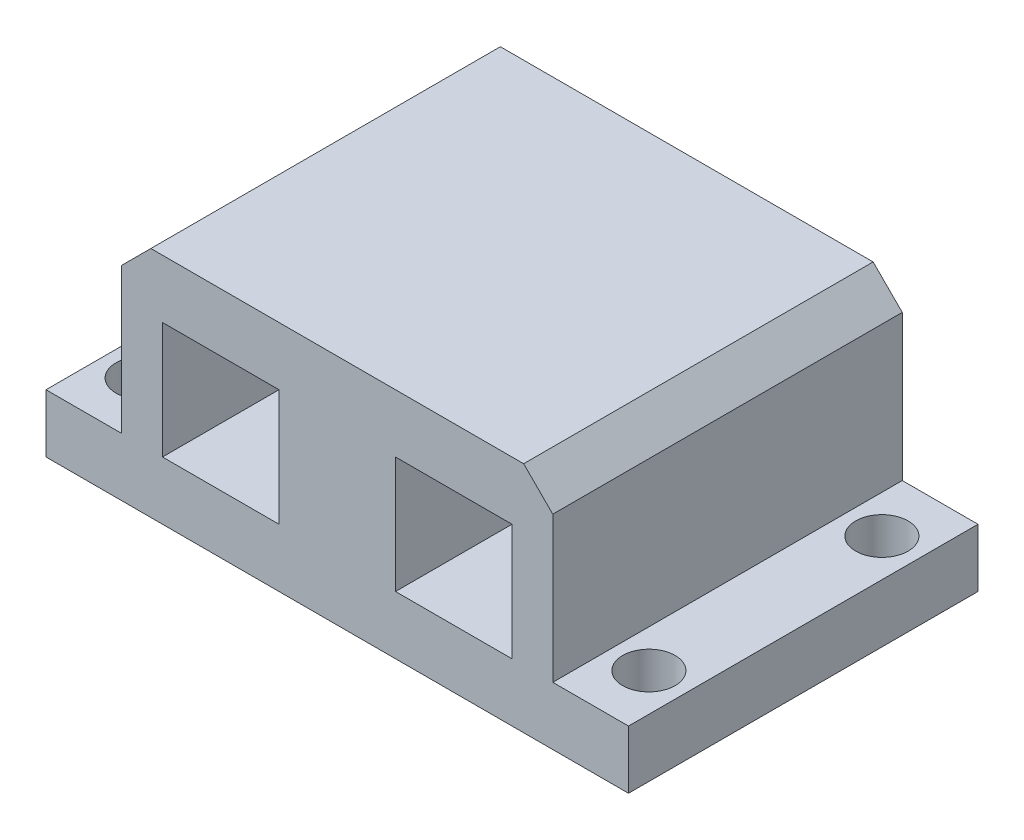
ISO-10303-21;
HEADER;
FILE_DESCRIPTION(('STEP AP214'),'2;1');
FILE_NAME('part.step','',(''),(''),'','','');
FILE_SCHEMA(('AUTOMOTIVE_DESIGN { 1 0 10303 214 1 1 1 1 }'));
ENDSEC;
DATA;
#1=APPLICATION_CONTEXT('core data for automotive mechanical design processes');
#2=APPLICATION_PROTOCOL_DEFINITION('international standard','automotive_design',2000,#1);
#3=PRODUCT_CONTEXT('',#1,'mechanical');
#4=PRODUCT('Part','Part','',(#3));
#5=PRODUCT_RELATED_PRODUCT_CATEGORY('part','',(#4));
#6=PRODUCT_DEFINITION_FORMATION('','',#4);
#7=PRODUCT_DEFINITION_CONTEXT('part definition',#1,'design');
#8=PRODUCT_DEFINITION('design','',#6,#7);
#9=PRODUCT_DEFINITION_SHAPE('','',#8);
#10=(LENGTH_UNIT() NAMED_UNIT(*) SI_UNIT(.MILLI.,.METRE.));
#11=(NAMED_UNIT(*) PLANE_ANGLE_UNIT() SI_UNIT($,.RADIAN.));
#12=(NAMED_UNIT(*) SI_UNIT($,.STERADIAN.) SOLID_ANGLE_UNIT());
#13=UNCERTAINTY_MEASURE_WITH_UNIT(LENGTH_MEASURE(1.E-05),#10,'distance_accuracy_value','');
#14=(GEOMETRIC_REPRESENTATION_CONTEXT(3) GLOBAL_UNCERTAINTY_ASSIGNED_CONTEXT((#13)) GLOBAL_UNIT_ASSIGNED_CONTEXT((#10,
#11,#12)) REPRESENTATION_CONTEXT('',''));
#15=CARTESIAN_POINT('',(0.,0.,0.));
#16=DIRECTION('',(0.,0.,1.));
#17=DIRECTION('',(1.,0.,0.));
#18=AXIS2_PLACEMENT_3D('',#15,#16,#17);
#19=CARTESIAN_POINT('',(-25.,-10.,30.));
#20=DIRECTION('',(0.,1.,0.));
#21=DIRECTION('',(0.,0.,1.));
#22=AXIS2_PLACEMENT_3D('',#19,#20,#21);
#23=PLANE('',#22);
#24=CARTESIAN_POINT('',(-21.75,-10.,25.));
#25=DIRECTION('',(0.,1.,0.));
#26=DIRECTION('',(0.,0.,1.));
#27=AXIS2_PLACEMENT_3D('',#24,#25,#26);
#28=CIRCLE('',#27,2.25);
#29=CARTESIAN_POINT('',(-21.75,-10.,27.25));
#30=VERTEX_POINT('',#29);
#31=EDGE_CURVE('E519',#30,#30,#28,.T.);
#32=ORIENTED_EDGE('',*,*,#31,.T.);
#33=EDGE_LOOP('',(#32));
#34=FACE_BOUND('',#33,.T.);
#35=CARTESIAN_POINT('',(-21.75,-10.,5.));
#36=DIRECTION('',(0.,1.,0.));
#37=DIRECTION('',(0.,0.,1.));
#38=AXIS2_PLACEMENT_3D('',#35,#36,#37);
#39=CIRCLE('',#38,2.25);
#40=CARTESIAN_POINT('',(-21.75,-10.,7.25));
#41=VERTEX_POINT('',#40);
#42=EDGE_CURVE('E197',#41,#41,#39,.T.);
#43=ORIENTED_EDGE('',*,*,#42,.T.);
#44=EDGE_LOOP('',(#43));
#45=FACE_BOUND('',#44,.T.);
#46=DIRECTION('',(1.,0.,0.));
#47=VECTOR('',#46,1.);
#48=CARTESIAN_POINT('',(-25.,-10.,0.));
#49=LINE('',#48,#47);
#50=CARTESIAN_POINT('',(-25.,-10.,0.));
#51=VERTEX_POINT('',#50);
#52=CARTESIAN_POINT('',(25.,-10.,0.));
#53=VERTEX_POINT('',#52);
#54=EDGE_CURVE('E260',#51,#53,#49,.T.);
#55=ORIENTED_EDGE('',*,*,#54,.T.);
#56=DIRECTION('',(0.,0.,-1.));
#57=VECTOR('',#56,1.);
#58=CARTESIAN_POINT('',(25.,-10.,30.));
#59=LINE('',#58,#57);
#60=CARTESIAN_POINT('',(25.,-10.,30.));
#61=VERTEX_POINT('',#60);
#62=EDGE_CURVE('E284',#61,#53,#59,.T.);
#63=ORIENTED_EDGE('',*,*,#62,.F.);
#64=DIRECTION('',(1.,0.,0.));
#65=VECTOR('',#64,1.);
#66=CARTESIAN_POINT('',(-25.,-10.,30.));
#67=LINE('',#66,#65);
#68=CARTESIAN_POINT('',(-25.,-10.,30.));
#69=VERTEX_POINT('',#68);
#70=EDGE_CURVE('E242',#69,#61,#67,.T.);
#71=ORIENTED_EDGE('',*,*,#70,.F.);
#72=DIRECTION('',(0.,0.,-1.));
#73=VECTOR('',#72,1.);
#74=CARTESIAN_POINT('',(-25.,-10.,30.));
#75=LINE('',#74,#73);
#76=EDGE_CURVE('E287',#69,#51,#75,.T.);
#77=ORIENTED_EDGE('',*,*,#76,.T.);
#78=EDGE_LOOP('',(#55,#63,#71,#77));
#79=FACE_BOUND('',#78,.T.);
#80=CARTESIAN_POINT('',(21.75,-10.,25.));
#81=DIRECTION('',(0.,1.,0.));
#82=DIRECTION('',(0.,0.,1.));
#83=AXIS2_PLACEMENT_3D('',#80,#81,#82);
#84=CIRCLE('',#83,2.25);
#85=CARTESIAN_POINT('',(21.75,-10.,27.25));
#86=VERTEX_POINT('',#85);
#87=EDGE_CURVE('E526',#86,#86,#84,.F.);
#88=ORIENTED_EDGE('',*,*,#87,.F.);
#89=EDGE_LOOP('',(#88));
#90=FACE_BOUND('',#89,.T.);
#91=CARTESIAN_POINT('',(21.75,-10.,4.99999999999998));
#92=DIRECTION('',(0.,1.,0.));
#93=DIRECTION('',(0.,0.,1.));
#94=AXIS2_PLACEMENT_3D('',#91,#92,#93);
#95=CIRCLE('',#94,2.25);
#96=CARTESIAN_POINT('',(21.75,-10.,7.24999999999998));
#97=VERTEX_POINT('',#96);
#98=EDGE_CURVE('E507',#97,#97,#95,.F.);
#99=ORIENTED_EDGE('',*,*,#98,.F.);
#100=EDGE_LOOP('',(#99));
#101=FACE_BOUND('',#100,.T.);
#102=ADVANCED_FACE('F35',(#34,#45,#79,#90,#101),#23,.F.);
#103=CARTESIAN_POINT('',(0.,0.,30.));
#104=DIRECTION('',(0.,0.,-1.));
#105=DIRECTION('',(-1.,0.,0.));
#106=AXIS2_PLACEMENT_3D('',#103,#104,#105);
#107=PLANE('',#106);
#108=DIRECTION('',(-1.,0.,0.));
#109=VECTOR('',#108,1.);
#110=CARTESIAN_POINT('',(5.00000000000001,5.,30.));
#111=LINE('',#110,#109);
#112=CARTESIAN_POINT('',(15.,5.,30.));
#113=VERTEX_POINT('',#112);
#114=CARTESIAN_POINT('',(5.00000000000001,5.,30.));
#115=VERTEX_POINT('',#114);
#116=EDGE_CURVE('E208',#113,#115,#111,.T.);
#117=ORIENTED_EDGE('',*,*,#116,.F.);
#118=DIRECTION('',(0.,1.,0.));
#119=VECTOR('',#118,1.);
#120=CARTESIAN_POINT('',(15.,-5.,30.));
#121=LINE('',#120,#119);
#122=CARTESIAN_POINT('',(15.,-5.,30.));
#123=VERTEX_POINT('',#122);
#124=EDGE_CURVE('E216',#123,#113,#121,.T.);
#125=ORIENTED_EDGE('',*,*,#124,.F.);
#126=DIRECTION('',(1.,0.,0.));
#127=VECTOR('',#126,1.);
#128=CARTESIAN_POINT('',(5.00000000000001,-5.,30.));
#129=LINE('',#128,#127);
#130=CARTESIAN_POINT('',(5.00000000000001,-5.,30.));
#131=VERTEX_POINT('',#130);
#132=EDGE_CURVE('E213',#131,#123,#129,.T.);
#133=ORIENTED_EDGE('',*,*,#132,.F.);
#134=DIRECTION('',(0.,-1.,0.));
#135=VECTOR('',#134,1.);
#136=CARTESIAN_POINT('',(5.00000000000001,5.,30.));
#137=LINE('',#136,#135);
#138=EDGE_CURVE('E210',#115,#131,#137,.T.);
#139=ORIENTED_EDGE('',*,*,#138,.F.);
#140=EDGE_LOOP('',(#117,#125,#133,#139));
#141=FACE_BOUND('',#140,.T.);
#142=DIRECTION('',(-1.,0.,0.));
#143=VECTOR('',#142,1.);
#144=CARTESIAN_POINT('',(-18.5,10.,30.));
#145=LINE('',#144,#143);
#146=CARTESIAN_POINT('',(16.,10.,30.));
#147=VERTEX_POINT('',#146);
#148=CARTESIAN_POINT('',(-16.,10.,30.));
#149=VERTEX_POINT('',#148);
#150=EDGE_CURVE('E251',#147,#149,#145,.T.);
#151=ORIENTED_EDGE('',*,*,#150,.T.);
#152=DIRECTION('',(0.707106781186548,0.707106781186547,0.));
#153=VECTOR('',#152,1.);
#154=CARTESIAN_POINT('',(-18.5,7.5,30.));
#155=LINE('',#154,#153);
#156=CARTESIAN_POINT('',(-18.5,7.5,30.));
#157=VERTEX_POINT('',#156);
#158=EDGE_CURVE('E44',#149,#157,#155,.F.);
#159=ORIENTED_EDGE('',*,*,#158,.T.);
#160=DIRECTION('',(0.,-1.,0.));
#161=VECTOR('',#160,1.);
#162=CARTESIAN_POINT('',(-18.5,-5.,30.));
#163=LINE('',#162,#161);
#164=CARTESIAN_POINT('',(-18.5,-5.,30.));
#165=VERTEX_POINT('',#164);
#166=EDGE_CURVE('E253',#157,#165,#163,.T.);
#167=ORIENTED_EDGE('',*,*,#166,.T.);
#168=DIRECTION('',(-1.,0.,0.));
#169=VECTOR('',#168,1.);
#170=CARTESIAN_POINT('',(-25.,-5.,30.));
#171=LINE('',#170,#169);
#172=CARTESIAN_POINT('',(-25.,-5.,30.));
#173=VERTEX_POINT('',#172);
#174=EDGE_CURVE('E255',#165,#173,#171,.T.);
#175=ORIENTED_EDGE('',*,*,#174,.T.);
#176=DIRECTION('',(0.,-1.,0.));
#177=VECTOR('',#176,1.);
#178=CARTESIAN_POINT('',(-25.,-10.,30.));
#179=LINE('',#178,#177);
#180=EDGE_CURVE('E239',#173,#69,#179,.T.);
#181=ORIENTED_EDGE('',*,*,#180,.T.);
#182=ORIENTED_EDGE('',*,*,#70,.T.);
#183=DIRECTION('',(0.,1.,0.));
#184=VECTOR('',#183,1.);
#185=CARTESIAN_POINT('',(25.,-10.,30.));
#186=LINE('',#185,#184);
#187=CARTESIAN_POINT('',(25.,-5.,30.));
#188=VERTEX_POINT('',#187);
#189=EDGE_CURVE('E245',#61,#188,#186,.T.);
#190=ORIENTED_EDGE('',*,*,#189,.T.);
#191=DIRECTION('',(-1.,0.,0.));
#192=VECTOR('',#191,1.);
#193=CARTESIAN_POINT('',(18.5,-5.,30.));
#194=LINE('',#193,#192);
#195=CARTESIAN_POINT('',(18.5,-5.,30.));
#196=VERTEX_POINT('',#195);
#197=EDGE_CURVE('E247',#188,#196,#194,.T.);
#198=ORIENTED_EDGE('',*,*,#197,.T.);
#199=DIRECTION('',(0.,1.,0.));
#200=VECTOR('',#199,1.);
#201=CARTESIAN_POINT('',(18.5,10.,30.));
#202=LINE('',#201,#200);
#203=CARTESIAN_POINT('',(18.5,7.49999999999999,30.));
#204=VERTEX_POINT('',#203);
#205=EDGE_CURVE('E249',#196,#204,#202,.T.);
#206=ORIENTED_EDGE('',*,*,#205,.T.);
#207=DIRECTION('',(0.707106781186546,-0.707106781186549,0.));
#208=VECTOR('',#207,1.);
#209=CARTESIAN_POINT('',(16.,10.,30.));
#210=LINE('',#209,#208);
#211=EDGE_CURVE('E301',#204,#147,#210,.F.);
#212=ORIENTED_EDGE('',*,*,#211,.T.);
#213=EDGE_LOOP('',(#151,#159,#167,#175,#181,#182,#190,#198,#206,#212));
#214=FACE_BOUND('',#213,.T.);
#215=DIRECTION('',(0.,-1.,0.));
#216=VECTOR('',#215,1.);
#217=CARTESIAN_POINT('',(-15.,-5.,30.));
#218=LINE('',#217,#216);
#219=CARTESIAN_POINT('',(-15.,5.,30.));
#220=VERTEX_POINT('',#219);
#221=CARTESIAN_POINT('',(-15.,-5.,30.));
#222=VERTEX_POINT('',#221);
#223=EDGE_CURVE('E164',#220,#222,#218,.T.);
#224=ORIENTED_EDGE('',*,*,#223,.F.);
#225=DIRECTION('',(-1.,0.,0.));
#226=VECTOR('',#225,1.);
#227=CARTESIAN_POINT('',(-15.,5.,30.));
#228=LINE('',#227,#226);
#229=CARTESIAN_POINT('',(-4.99999999999999,5.,30.));
#230=VERTEX_POINT('',#229);
#231=EDGE_CURVE('E190',#230,#220,#228,.T.);
#232=ORIENTED_EDGE('',*,*,#231,.F.);
#233=DIRECTION('',(0.,1.,0.));
#234=VECTOR('',#233,1.);
#235=CARTESIAN_POINT('',(-4.99999999999999,5.,30.));
#236=LINE('',#235,#234);
#237=CARTESIAN_POINT('',(-4.99999999999999,-5.,30.));
#238=VERTEX_POINT('',#237);
#239=EDGE_CURVE('E188',#238,#230,#236,.T.);
#240=ORIENTED_EDGE('',*,*,#239,.F.);
#241=DIRECTION('',(1.,0.,0.));
#242=VECTOR('',#241,1.);
#243=CARTESIAN_POINT('',(-15.,-5.,30.));
#244=LINE('',#243,#242);
#245=EDGE_CURVE('E174',#222,#238,#244,.T.);
#246=ORIENTED_EDGE('',*,*,#245,.F.);
#247=EDGE_LOOP('',(#224,#232,#240,#246));
#248=FACE_BOUND('',#247,.T.);
#249=ADVANCED_FACE('F186',(#141,#214,#248),#107,.F.);
#250=CARTESIAN_POINT('',(0.,0.,0.));
#251=DIRECTION('',(0.,0.,-1.));
#252=DIRECTION('',(-1.,0.,0.));
#253=AXIS2_PLACEMENT_3D('',#250,#251,#252);
#254=PLANE('',#253);
#255=DIRECTION('',(0.,-1.,0.));
#256=VECTOR('',#255,1.);
#257=CARTESIAN_POINT('',(-18.5,-5.,0.));
#258=LINE('',#257,#256);
#259=CARTESIAN_POINT('',(-18.5,7.5,0.));
#260=VERTEX_POINT('',#259);
#261=CARTESIAN_POINT('',(-18.5,-5.,0.));
#262=VERTEX_POINT('',#261);
#263=EDGE_CURVE('E270',#260,#262,#258,.T.);
#264=ORIENTED_EDGE('',*,*,#263,.F.);
#265=DIRECTION('',(-0.707106781186548,-0.707106781186547,0.));
#266=VECTOR('',#265,1.);
#267=CARTESIAN_POINT('',(-13.,13.,0.));
#268=LINE('',#267,#266);
#269=CARTESIAN_POINT('',(-16.,10.,0.));
#270=VERTEX_POINT('',#269);
#271=EDGE_CURVE('E295',#260,#270,#268,.F.);
#272=ORIENTED_EDGE('',*,*,#271,.T.);
#273=DIRECTION('',(-1.,0.,0.));
#274=VECTOR('',#273,1.);
#275=CARTESIAN_POINT('',(-18.5,10.,0.));
#276=LINE('',#275,#274);
#277=CARTESIAN_POINT('',(16.,10.,0.));
#278=VERTEX_POINT('',#277);
#279=EDGE_CURVE('E268',#278,#270,#276,.T.);
#280=ORIENTED_EDGE('',*,*,#279,.F.);
#281=DIRECTION('',(-0.707106781186546,0.707106781186549,0.));
#282=VECTOR('',#281,1.);
#283=CARTESIAN_POINT('',(13.,13.,0.));
#284=LINE('',#283,#282);
#285=CARTESIAN_POINT('',(18.5,7.49999999999999,0.));
#286=VERTEX_POINT('',#285);
#287=EDGE_CURVE('E293',#278,#286,#284,.F.);
#288=ORIENTED_EDGE('',*,*,#287,.T.);
#289=DIRECTION('',(0.,1.,0.));
#290=VECTOR('',#289,1.);
#291=CARTESIAN_POINT('',(18.5,10.,0.));
#292=LINE('',#291,#290);
#293=CARTESIAN_POINT('',(18.5,-5.,0.));
#294=VERTEX_POINT('',#293);
#295=EDGE_CURVE('E266',#294,#286,#292,.T.);
#296=ORIENTED_EDGE('',*,*,#295,.F.);
#297=DIRECTION('',(-1.,0.,0.));
#298=VECTOR('',#297,1.);
#299=CARTESIAN_POINT('',(18.5,-5.,0.));
#300=LINE('',#299,#298);
#301=CARTESIAN_POINT('',(25.,-5.,0.));
#302=VERTEX_POINT('',#301);
#303=EDGE_CURVE('E264',#302,#294,#300,.T.);
#304=ORIENTED_EDGE('',*,*,#303,.F.);
#305=DIRECTION('',(0.,1.,0.));
#306=VECTOR('',#305,1.);
#307=CARTESIAN_POINT('',(25.,-10.,0.));
#308=LINE('',#307,#306);
#309=EDGE_CURVE('E262',#53,#302,#308,.T.);
#310=ORIENTED_EDGE('',*,*,#309,.F.);
#311=ORIENTED_EDGE('',*,*,#54,.F.);
#312=DIRECTION('',(0.,-1.,0.));
#313=VECTOR('',#312,1.);
#314=CARTESIAN_POINT('',(-25.,-10.,0.));
#315=LINE('',#314,#313);
#316=CARTESIAN_POINT('',(-25.,-5.,0.));
#317=VERTEX_POINT('',#316);
#318=EDGE_CURVE('E238',#317,#51,#315,.T.);
#319=ORIENTED_EDGE('',*,*,#318,.F.);
#320=DIRECTION('',(-1.,0.,0.));
#321=VECTOR('',#320,1.);
#322=CARTESIAN_POINT('',(-25.,-5.,0.));
#323=LINE('',#322,#321);
#324=EDGE_CURVE('E243',#262,#317,#323,.T.);
#325=ORIENTED_EDGE('',*,*,#324,.F.);
#326=EDGE_LOOP('',(#264,#272,#280,#288,#296,#304,#310,#311,#319,#325));
#327=FACE_BOUND('',#326,.T.);
#328=DIRECTION('',(0.,1.,0.));
#329=VECTOR('',#328,1.);
#330=CARTESIAN_POINT('',(15.,-5.,0.));
#331=LINE('',#330,#329);
#332=CARTESIAN_POINT('',(15.,-5.,0.));
#333=VERTEX_POINT('',#332);
#334=CARTESIAN_POINT('',(15.,5.,0.));
#335=VERTEX_POINT('',#334);
#336=EDGE_CURVE('E211',#333,#335,#331,.T.);
#337=ORIENTED_EDGE('',*,*,#336,.T.);
#338=DIRECTION('',(-1.,0.,0.));
#339=VECTOR('',#338,1.);
#340=CARTESIAN_POINT('',(5.00000000000001,5.,0.));
#341=LINE('',#340,#339);
#342=CARTESIAN_POINT('',(5.00000000000001,5.,0.));
#343=VERTEX_POINT('',#342);
#344=EDGE_CURVE('E182',#335,#343,#341,.T.);
#345=ORIENTED_EDGE('',*,*,#344,.T.);
#346=DIRECTION('',(0.,-1.,0.));
#347=VECTOR('',#346,1.);
#348=CARTESIAN_POINT('',(5.00000000000001,5.,0.));
#349=LINE('',#348,#347);
#350=CARTESIAN_POINT('',(5.00000000000001,-5.,0.));
#351=VERTEX_POINT('',#350);
#352=EDGE_CURVE('E221',#343,#351,#349,.T.);
#353=ORIENTED_EDGE('',*,*,#352,.T.);
#354=DIRECTION('',(1.,0.,0.));
#355=VECTOR('',#354,1.);
#356=CARTESIAN_POINT('',(5.00000000000001,-5.,0.));
#357=LINE('',#356,#355);
#358=EDGE_CURVE('E224',#351,#333,#357,.T.);
#359=ORIENTED_EDGE('',*,*,#358,.T.);
#360=EDGE_LOOP('',(#337,#345,#353,#359));
#361=FACE_BOUND('',#360,.T.);
#362=DIRECTION('',(-1.,0.,0.));
#363=VECTOR('',#362,1.);
#364=CARTESIAN_POINT('',(-15.,5.,0.));
#365=LINE('',#364,#363);
#366=CARTESIAN_POINT('',(-4.99999999999999,5.,0.));
#367=VERTEX_POINT('',#366);
#368=CARTESIAN_POINT('',(-15.,5.,0.));
#369=VERTEX_POINT('',#368);
#370=EDGE_CURVE('E175',#367,#369,#365,.T.);
#371=ORIENTED_EDGE('',*,*,#370,.T.);
#372=DIRECTION('',(0.,-1.,0.));
#373=VECTOR('',#372,1.);
#374=CARTESIAN_POINT('',(-15.,-5.,0.));
#375=LINE('',#374,#373);
#376=CARTESIAN_POINT('',(-15.,-5.,0.));
#377=VERTEX_POINT('',#376);
#378=EDGE_CURVE('E195',#369,#377,#375,.T.);
#379=ORIENTED_EDGE('',*,*,#378,.T.);
#380=DIRECTION('',(1.,0.,0.));
#381=VECTOR('',#380,1.);
#382=CARTESIAN_POINT('',(-15.,-5.,0.));
#383=LINE('',#382,#381);
#384=CARTESIAN_POINT('',(-4.99999999999999,-5.,0.));
#385=VERTEX_POINT('',#384);
#386=EDGE_CURVE('E181',#377,#385,#383,.T.);
#387=ORIENTED_EDGE('',*,*,#386,.T.);
#388=DIRECTION('',(0.,1.,0.));
#389=VECTOR('',#388,1.);
#390=CARTESIAN_POINT('',(-4.99999999999999,5.,0.));
#391=LINE('',#390,#389);
#392=EDGE_CURVE('E199',#385,#367,#391,.T.);
#393=ORIENTED_EDGE('',*,*,#392,.T.);
#394=EDGE_LOOP('',(#371,#379,#387,#393));
#395=FACE_BOUND('',#394,.T.);
#396=ADVANCED_FACE('F315',(#327,#361,#395),#254,.T.);
#397=CARTESIAN_POINT('',(-25.,-10.,30.));
#398=DIRECTION('',(1.,0.,0.));
#399=DIRECTION('',(0.,0.,-1.));
#400=AXIS2_PLACEMENT_3D('',#397,#398,#399);
#401=PLANE('',#400);
#402=ORIENTED_EDGE('',*,*,#318,.T.);
#403=ORIENTED_EDGE('',*,*,#76,.F.);
#404=ORIENTED_EDGE('',*,*,#180,.F.);
#405=DIRECTION('',(0.,0.,-1.));
#406=VECTOR('',#405,1.);
#407=CARTESIAN_POINT('',(-25.,-5.,30.));
#408=LINE('',#407,#406);
#409=EDGE_CURVE('E257',#173,#317,#408,.T.);
#410=ORIENTED_EDGE('',*,*,#409,.T.);
#411=EDGE_LOOP('',(#402,#403,#404,#410));
#412=FACE_BOUND('',#411,.T.);
#413=ADVANCED_FACE('F341',(#412),#401,.F.);
#414=CARTESIAN_POINT('',(25.,-10.,30.));
#415=DIRECTION('',(-1.,0.,0.));
#416=DIRECTION('',(0.,0.,1.));
#417=AXIS2_PLACEMENT_3D('',#414,#415,#416);
#418=PLANE('',#417);
#419=ORIENTED_EDGE('',*,*,#309,.T.);
#420=DIRECTION('',(0.,0.,-1.));
#421=VECTOR('',#420,1.);
#422=CARTESIAN_POINT('',(25.,-5.,30.));
#423=LINE('',#422,#421);
#424=EDGE_CURVE('E281',#188,#302,#423,.T.);
#425=ORIENTED_EDGE('',*,*,#424,.F.);
#426=ORIENTED_EDGE('',*,*,#189,.F.);
#427=ORIENTED_EDGE('',*,*,#62,.T.);
#428=EDGE_LOOP('',(#419,#425,#426,#427));
#429=FACE_BOUND('',#428,.T.);
#430=ADVANCED_FACE('F333',(#429),#418,.F.);
#431=CARTESIAN_POINT('',(18.5,-5.,30.));
#432=DIRECTION('',(0.,-1.,0.));
#433=DIRECTION('',(0.,0.,-1.));
#434=AXIS2_PLACEMENT_3D('',#431,#432,#433);
#435=PLANE('',#434);
#436=CARTESIAN_POINT('',(21.75,-5.,4.99999999999998));
#437=DIRECTION('',(0.,1.,0.));
#438=DIRECTION('',(0.,0.,1.));
#439=AXIS2_PLACEMENT_3D('',#436,#437,#438);
#440=CIRCLE('',#439,2.25);
#441=CARTESIAN_POINT('',(21.75,-5.,7.24999999999998));
#442=VERTEX_POINT('',#441);
#443=EDGE_CURVE('E510',#442,#442,#440,.F.);
#444=ORIENTED_EDGE('',*,*,#443,.T.);
#445=EDGE_LOOP('',(#444));
#446=FACE_BOUND('',#445,.T.);
#447=CARTESIAN_POINT('',(21.75,-5.,25.));
#448=DIRECTION('',(0.,1.,0.));
#449=DIRECTION('',(0.,0.,1.));
#450=AXIS2_PLACEMENT_3D('',#447,#448,#449);
#451=CIRCLE('',#450,2.25);
#452=CARTESIAN_POINT('',(21.75,-5.,27.25));
#453=VERTEX_POINT('',#452);
#454=EDGE_CURVE('E512',#453,#453,#451,.F.);
#455=ORIENTED_EDGE('',*,*,#454,.T.);
#456=EDGE_LOOP('',(#455));
#457=FACE_BOUND('',#456,.T.);
#458=ORIENTED_EDGE('',*,*,#303,.T.);
#459=DIRECTION('',(0.,0.,-1.));
#460=VECTOR('',#459,1.);
#461=CARTESIAN_POINT('',(18.5,-5.,30.));
#462=LINE('',#461,#460);
#463=EDGE_CURVE('E278',#196,#294,#462,.T.);
#464=ORIENTED_EDGE('',*,*,#463,.F.);
#465=ORIENTED_EDGE('',*,*,#197,.F.);
#466=ORIENTED_EDGE('',*,*,#424,.T.);
#467=EDGE_LOOP('',(#458,#464,#465,#466));
#468=FACE_BOUND('',#467,.T.);
#469=ADVANCED_FACE('F328',(#446,#457,#468),#435,.F.);
#470=CARTESIAN_POINT('',(18.5,10.,30.));
#471=DIRECTION('',(-1.,0.,0.));
#472=DIRECTION('',(0.,-1.,0.));
#473=AXIS2_PLACEMENT_3D('',#470,#471,#472);
#474=PLANE('',#473);
#475=ORIENTED_EDGE('',*,*,#295,.T.);
#476=DIRECTION('',(0.,0.,1.));
#477=VECTOR('',#476,1.);
#478=CARTESIAN_POINT('',(18.5,7.49999999999999,30.));
#479=LINE('',#478,#477);
#480=EDGE_CURVE('E11',#286,#204,#479,.T.);
#481=ORIENTED_EDGE('',*,*,#480,.T.);
#482=ORIENTED_EDGE('',*,*,#205,.F.);
#483=ORIENTED_EDGE('',*,*,#463,.T.);
#484=EDGE_LOOP('',(#475,#481,#482,#483));
#485=FACE_BOUND('',#484,.T.);
#486=ADVANCED_FACE('F324',(#485),#474,.F.);
#487=CARTESIAN_POINT('',(-18.5,10.,30.));
#488=DIRECTION('',(0.,-1.,0.));
#489=DIRECTION('',(0.,0.,-1.));
#490=AXIS2_PLACEMENT_3D('',#487,#488,#489);
#491=PLANE('',#490);
#492=ORIENTED_EDGE('',*,*,#279,.T.);
#493=DIRECTION('',(0.,0.,1.));
#494=VECTOR('',#493,1.);
#495=CARTESIAN_POINT('',(-16.,10.,30.));
#496=LINE('',#495,#494);
#497=EDGE_CURVE('E57',#270,#149,#496,.T.);
#498=ORIENTED_EDGE('',*,*,#497,.T.);
#499=ORIENTED_EDGE('',*,*,#150,.F.);
#500=DIRECTION('',(0.,0.,-1.));
#501=VECTOR('',#500,1.);
#502=CARTESIAN_POINT('',(16.,10.,30.));
#503=LINE('',#502,#501);
#504=EDGE_CURVE('E297',#147,#278,#503,.T.);
#505=ORIENTED_EDGE('',*,*,#504,.T.);
#506=EDGE_LOOP('',(#492,#498,#499,#505));
#507=FACE_BOUND('',#506,.T.);
#508=ADVANCED_FACE('F318',(#507),#491,.F.);
#509=CARTESIAN_POINT('',(-18.5,-5.,30.));
#510=DIRECTION('',(1.,0.,0.));
#511=DIRECTION('',(0.,0.,-1.));
#512=AXIS2_PLACEMENT_3D('',#509,#510,#511);
#513=PLANE('',#512);
#514=ORIENTED_EDGE('',*,*,#166,.F.);
#515=DIRECTION('',(0.,0.,-1.));
#516=VECTOR('',#515,1.);
#517=CARTESIAN_POINT('',(-18.5,7.5,30.));
#518=LINE('',#517,#516);
#519=EDGE_CURVE('E290',#157,#260,#518,.T.);
#520=ORIENTED_EDGE('',*,*,#519,.T.);
#521=ORIENTED_EDGE('',*,*,#263,.T.);
#522=DIRECTION('',(0.,0.,-1.));
#523=VECTOR('',#522,1.);
#524=CARTESIAN_POINT('',(-18.5,-5.,30.));
#525=LINE('',#524,#523);
#526=EDGE_CURVE('E275',#165,#262,#525,.T.);
#527=ORIENTED_EDGE('',*,*,#526,.F.);
#528=EDGE_LOOP('',(#514,#520,#521,#527));
#529=FACE_BOUND('',#528,.T.);
#530=ADVANCED_FACE('F309',(#529),#513,.F.);
#531=CARTESIAN_POINT('',(-25.,-5.,30.));
#532=DIRECTION('',(0.,-1.,0.));
#533=DIRECTION('',(0.,0.,-1.));
#534=AXIS2_PLACEMENT_3D('',#531,#532,#533);
#535=PLANE('',#534);
#536=CARTESIAN_POINT('',(-21.75,-5.,25.));
#537=DIRECTION('',(0.,1.,0.));
#538=DIRECTION('',(0.,0.,1.));
#539=AXIS2_PLACEMENT_3D('',#536,#537,#538);
#540=CIRCLE('',#539,2.25);
#541=CARTESIAN_POINT('',(-21.75,-5.,27.25));
#542=VERTEX_POINT('',#541);
#543=EDGE_CURVE('E522',#542,#542,#540,.T.);
#544=ORIENTED_EDGE('',*,*,#543,.F.);
#545=EDGE_LOOP('',(#544));
#546=FACE_BOUND('',#545,.T.);
#547=CARTESIAN_POINT('',(-21.75,-5.,5.));
#548=DIRECTION('',(0.,1.,0.));
#549=DIRECTION('',(0.,0.,1.));
#550=AXIS2_PLACEMENT_3D('',#547,#548,#549);
#551=CIRCLE('',#550,2.25);
#552=CARTESIAN_POINT('',(-21.75,-5.,7.25));
#553=VERTEX_POINT('',#552);
#554=EDGE_CURVE('E517',#553,#553,#551,.T.);
#555=ORIENTED_EDGE('',*,*,#554,.F.);
#556=EDGE_LOOP('',(#555));
#557=FACE_BOUND('',#556,.T.);
#558=ORIENTED_EDGE('',*,*,#324,.T.);
#559=ORIENTED_EDGE('',*,*,#409,.F.);
#560=ORIENTED_EDGE('',*,*,#174,.F.);
#561=ORIENTED_EDGE('',*,*,#526,.T.);
#562=EDGE_LOOP('',(#558,#559,#560,#561));
#563=FACE_BOUND('',#562,.T.);
#564=ADVANCED_FACE('F344',(#546,#557,#563),#535,.F.);
#565=CARTESIAN_POINT('',(5.00000000000001,5.,30.));
#566=DIRECTION('',(0.,-1.,0.));
#567=DIRECTION('',(1.,0.,0.));
#568=AXIS2_PLACEMENT_3D('',#565,#566,#567);
#569=PLANE('',#568);
#570=ORIENTED_EDGE('',*,*,#344,.F.);
#571=DIRECTION('',(0.,0.,-1.));
#572=VECTOR('',#571,1.);
#573=CARTESIAN_POINT('',(15.,5.,30.));
#574=LINE('',#573,#572);
#575=EDGE_CURVE('E218',#113,#335,#574,.T.);
#576=ORIENTED_EDGE('',*,*,#575,.F.);
#577=ORIENTED_EDGE('',*,*,#116,.T.);
#578=DIRECTION('',(0.,0.,-1.));
#579=VECTOR('',#578,1.);
#580=CARTESIAN_POINT('',(5.00000000000001,5.,30.));
#581=LINE('',#580,#579);
#582=EDGE_CURVE('E235',#115,#343,#581,.T.);
#583=ORIENTED_EDGE('',*,*,#582,.T.);
#584=EDGE_LOOP('',(#570,#576,#577,#583));
#585=FACE_BOUND('',#584,.T.);
#586=ADVANCED_FACE('F346',(#585),#569,.T.);
#587=CARTESIAN_POINT('',(5.00000000000001,5.,30.));
#588=DIRECTION('',(1.,0.,0.));
#589=DIRECTION('',(0.,1.,0.));
#590=AXIS2_PLACEMENT_3D('',#587,#588,#589);
#591=PLANE('',#590);
#592=ORIENTED_EDGE('',*,*,#352,.F.);
#593=ORIENTED_EDGE('',*,*,#582,.F.);
#594=ORIENTED_EDGE('',*,*,#138,.T.);
#595=DIRECTION('',(0.,0.,-1.));
#596=VECTOR('',#595,1.);
#597=CARTESIAN_POINT('',(5.00000000000001,-5.,30.));
#598=LINE('',#597,#596);
#599=EDGE_CURVE('E233',#131,#351,#598,.T.);
#600=ORIENTED_EDGE('',*,*,#599,.T.);
#601=EDGE_LOOP('',(#592,#593,#594,#600));
#602=FACE_BOUND('',#601,.T.);
#603=ADVANCED_FACE('F353',(#602),#591,.T.);
#604=CARTESIAN_POINT('',(5.00000000000001,-5.,30.));
#605=DIRECTION('',(0.,1.,0.));
#606=DIRECTION('',(-1.,0.,0.));
#607=AXIS2_PLACEMENT_3D('',#604,#605,#606);
#608=PLANE('',#607);
#609=ORIENTED_EDGE('',*,*,#358,.F.);
#610=ORIENTED_EDGE('',*,*,#599,.F.);
#611=ORIENTED_EDGE('',*,*,#132,.T.);
#612=DIRECTION('',(0.,0.,-1.));
#613=VECTOR('',#612,1.);
#614=CARTESIAN_POINT('',(15.,-5.,30.));
#615=LINE('',#614,#613);
#616=EDGE_CURVE('E231',#123,#333,#615,.T.);
#617=ORIENTED_EDGE('',*,*,#616,.T.);
#618=EDGE_LOOP('',(#609,#610,#611,#617));
#619=FACE_BOUND('',#618,.T.);
#620=ADVANCED_FACE('F403',(#619),#608,.T.);
#621=CARTESIAN_POINT('',(15.,-5.,30.));
#622=DIRECTION('',(-1.,0.,0.));
#623=DIRECTION('',(0.,-1.,0.));
#624=AXIS2_PLACEMENT_3D('',#621,#622,#623);
#625=PLANE('',#624);
#626=ORIENTED_EDGE('',*,*,#336,.F.);
#627=ORIENTED_EDGE('',*,*,#616,.F.);
#628=ORIENTED_EDGE('',*,*,#124,.T.);
#629=ORIENTED_EDGE('',*,*,#575,.T.);
#630=EDGE_LOOP('',(#626,#627,#628,#629));
#631=FACE_BOUND('',#630,.T.);
#632=ADVANCED_FACE('F400',(#631),#625,.T.);
#633=CARTESIAN_POINT('',(-15.,-5.,30.));
#634=DIRECTION('',(1.,0.,0.));
#635=DIRECTION('',(0.,0.,-1.));
#636=AXIS2_PLACEMENT_3D('',#633,#634,#635);
#637=PLANE('',#636);
#638=ORIENTED_EDGE('',*,*,#378,.F.);
#639=DIRECTION('',(0.,0.,-1.));
#640=VECTOR('',#639,1.);
#641=CARTESIAN_POINT('',(-15.,5.,30.));
#642=LINE('',#641,#640);
#643=EDGE_CURVE('E170',#220,#369,#642,.T.);
#644=ORIENTED_EDGE('',*,*,#643,.F.);
#645=ORIENTED_EDGE('',*,*,#223,.T.);
#646=DIRECTION('',(0.,0.,-1.));
#647=VECTOR('',#646,1.);
#648=CARTESIAN_POINT('',(-15.,-5.,30.));
#649=LINE('',#648,#647);
#650=EDGE_CURVE('E167',#222,#377,#649,.T.);
#651=ORIENTED_EDGE('',*,*,#650,.T.);
#652=EDGE_LOOP('',(#638,#644,#645,#651));
#653=FACE_BOUND('',#652,.T.);
#654=ADVANCED_FACE('F166',(#653),#637,.T.);
#655=CARTESIAN_POINT('',(-15.,-5.,30.));
#656=DIRECTION('',(0.,1.,0.));
#657=DIRECTION('',(-1.,0.,0.));
#658=AXIS2_PLACEMENT_3D('',#655,#656,#657);
#659=PLANE('',#658);
#660=ORIENTED_EDGE('',*,*,#386,.F.);
#661=ORIENTED_EDGE('',*,*,#650,.F.);
#662=ORIENTED_EDGE('',*,*,#245,.T.);
#663=DIRECTION('',(0.,0.,-1.));
#664=VECTOR('',#663,1.);
#665=CARTESIAN_POINT('',(-4.99999999999999,-5.,30.));
#666=LINE('',#665,#664);
#667=EDGE_CURVE('E183',#238,#385,#666,.T.);
#668=ORIENTED_EDGE('',*,*,#667,.T.);
#669=EDGE_LOOP('',(#660,#661,#662,#668));
#670=FACE_BOUND('',#669,.T.);
#671=ADVANCED_FACE('F178',(#670),#659,.T.);
#672=CARTESIAN_POINT('',(-4.99999999999999,5.,30.));
#673=DIRECTION('',(-1.,0.,0.));
#674=DIRECTION('',(0.,-1.,0.));
#675=AXIS2_PLACEMENT_3D('',#672,#673,#674);
#676=PLANE('',#675);
#677=ORIENTED_EDGE('',*,*,#392,.F.);
#678=ORIENTED_EDGE('',*,*,#667,.F.);
#679=ORIENTED_EDGE('',*,*,#239,.T.);
#680=DIRECTION('',(0.,0.,-1.));
#681=VECTOR('',#680,1.);
#682=CARTESIAN_POINT('',(-4.99999999999999,5.,30.));
#683=LINE('',#682,#681);
#684=EDGE_CURVE('E205',#230,#367,#683,.T.);
#685=ORIENTED_EDGE('',*,*,#684,.T.);
#686=EDGE_LOOP('',(#677,#678,#679,#685));
#687=FACE_BOUND('',#686,.T.);
#688=ADVANCED_FACE('F384',(#687),#676,.T.);
#689=CARTESIAN_POINT('',(-15.,5.,30.));
#690=DIRECTION('',(0.,-1.,0.));
#691=DIRECTION('',(1.,0.,0.));
#692=AXIS2_PLACEMENT_3D('',#689,#690,#691);
#693=PLANE('',#692);
#694=ORIENTED_EDGE('',*,*,#370,.F.);
#695=ORIENTED_EDGE('',*,*,#684,.F.);
#696=ORIENTED_EDGE('',*,*,#231,.T.);
#697=ORIENTED_EDGE('',*,*,#643,.T.);
#698=EDGE_LOOP('',(#694,#695,#696,#697));
#699=FACE_BOUND('',#698,.T.);
#700=ADVANCED_FACE('F378',(#699),#693,.T.);
#701=CARTESIAN_POINT('',(-18.5,7.5,30.));
#702=DIRECTION('',(0.707106781186547,-0.707106781186548,0.));
#703=DIRECTION('',(0.,0.,-1.));
#704=AXIS2_PLACEMENT_3D('',#701,#702,#703);
#705=PLANE('',#704);
#706=ORIENTED_EDGE('',*,*,#158,.F.);
#707=ORIENTED_EDGE('',*,*,#497,.F.);
#708=ORIENTED_EDGE('',*,*,#271,.F.);
#709=ORIENTED_EDGE('',*,*,#519,.F.);
#710=EDGE_LOOP('',(#706,#707,#708,#709));
#711=FACE_BOUND('',#710,.T.);
#712=ADVANCED_FACE('F312',(#711),#705,.F.);
#713=CARTESIAN_POINT('',(16.,10.,30.));
#714=DIRECTION('',(-0.707106781186549,-0.707106781186546,0.));
#715=DIRECTION('',(0.,0.,-1.));
#716=AXIS2_PLACEMENT_3D('',#713,#714,#715);
#717=PLANE('',#716);
#718=ORIENTED_EDGE('',*,*,#211,.F.);
#719=ORIENTED_EDGE('',*,*,#480,.F.);
#720=ORIENTED_EDGE('',*,*,#287,.F.);
#721=ORIENTED_EDGE('',*,*,#504,.F.);
#722=EDGE_LOOP('',(#718,#719,#720,#721));
#723=FACE_BOUND('',#722,.T.);
#724=ADVANCED_FACE('F38',(#723),#717,.F.);
#725=CARTESIAN_POINT('',(-21.75,-10.,5.));
#726=DIRECTION('',(0.,1.,0.));
#727=DIRECTION('',(0.,0.,1.));
#728=AXIS2_PLACEMENT_3D('',#725,#726,#727);
#729=CYLINDRICAL_SURFACE('',#728,2.25);
#730=ORIENTED_EDGE('',*,*,#42,.F.);
#731=EDGE_LOOP('',(#730));
#732=FACE_BOUND('',#731,.T.);
#733=ORIENTED_EDGE('',*,*,#554,.T.);
#734=EDGE_LOOP('',(#733));
#735=FACE_BOUND('',#734,.T.);
#736=ADVANCED_FACE('F383',(#732,#735),#729,.F.);
#737=CARTESIAN_POINT('',(-21.75,-10.,25.));
#738=DIRECTION('',(0.,1.,0.));
#739=DIRECTION('',(0.,0.,1.));
#740=AXIS2_PLACEMENT_3D('',#737,#738,#739);
#741=CYLINDRICAL_SURFACE('',#740,2.25);
#742=ORIENTED_EDGE('',*,*,#31,.F.);
#743=EDGE_LOOP('',(#742));
#744=FACE_BOUND('',#743,.T.);
#745=ORIENTED_EDGE('',*,*,#543,.T.);
#746=EDGE_LOOP('',(#745));
#747=FACE_BOUND('',#746,.T.);
#748=ADVANCED_FACE('F473',(#744,#747),#741,.F.);
#749=CARTESIAN_POINT('',(21.75,-10.,25.));
#750=DIRECTION('',(0.,1.,0.));
#751=DIRECTION('',(0.,0.,1.));
#752=AXIS2_PLACEMENT_3D('',#749,#750,#751);
#753=CYLINDRICAL_SURFACE('',#752,2.25);
#754=ORIENTED_EDGE('',*,*,#87,.T.);
#755=EDGE_LOOP('',(#754));
#756=FACE_BOUND('',#755,.T.);
#757=ORIENTED_EDGE('',*,*,#454,.F.);
#758=EDGE_LOOP('',(#757));
#759=FACE_BOUND('',#758,.T.);
#760=ADVANCED_FACE('F481',(#756,#759),#753,.F.);
#761=CARTESIAN_POINT('',(21.75,-10.,4.99999999999998));
#762=DIRECTION('',(0.,1.,0.));
#763=DIRECTION('',(0.,0.,1.));
#764=AXIS2_PLACEMENT_3D('',#761,#762,#763);
#765=CYLINDRICAL_SURFACE('',#764,2.25);
#766=ORIENTED_EDGE('',*,*,#98,.T.);
#767=EDGE_LOOP('',(#766));
#768=FACE_BOUND('',#767,.T.);
#769=ORIENTED_EDGE('',*,*,#443,.F.);
#770=EDGE_LOOP('',(#769));
#771=FACE_BOUND('',#770,.T.);
#772=ADVANCED_FACE('F490',(#768,#771),#765,.F.);
#773=CLOSED_SHELL('',(#102,#249,#396,#413,#430,#469,#486,#508,#530,#564,#586,#603,#620,#632,
#654,#671,#688,#700,#712,#724,#736,#748,#760,#772));
#774=MANIFOLD_SOLID_BREP('B2',#773);
#775=ADVANCED_BREP_SHAPE_REPRESENTATION('',(#18,#774),#14);
#776=SHAPE_DEFINITION_REPRESENTATION(#9,#775);
ENDSEC;
END-ISO-10303-21;
